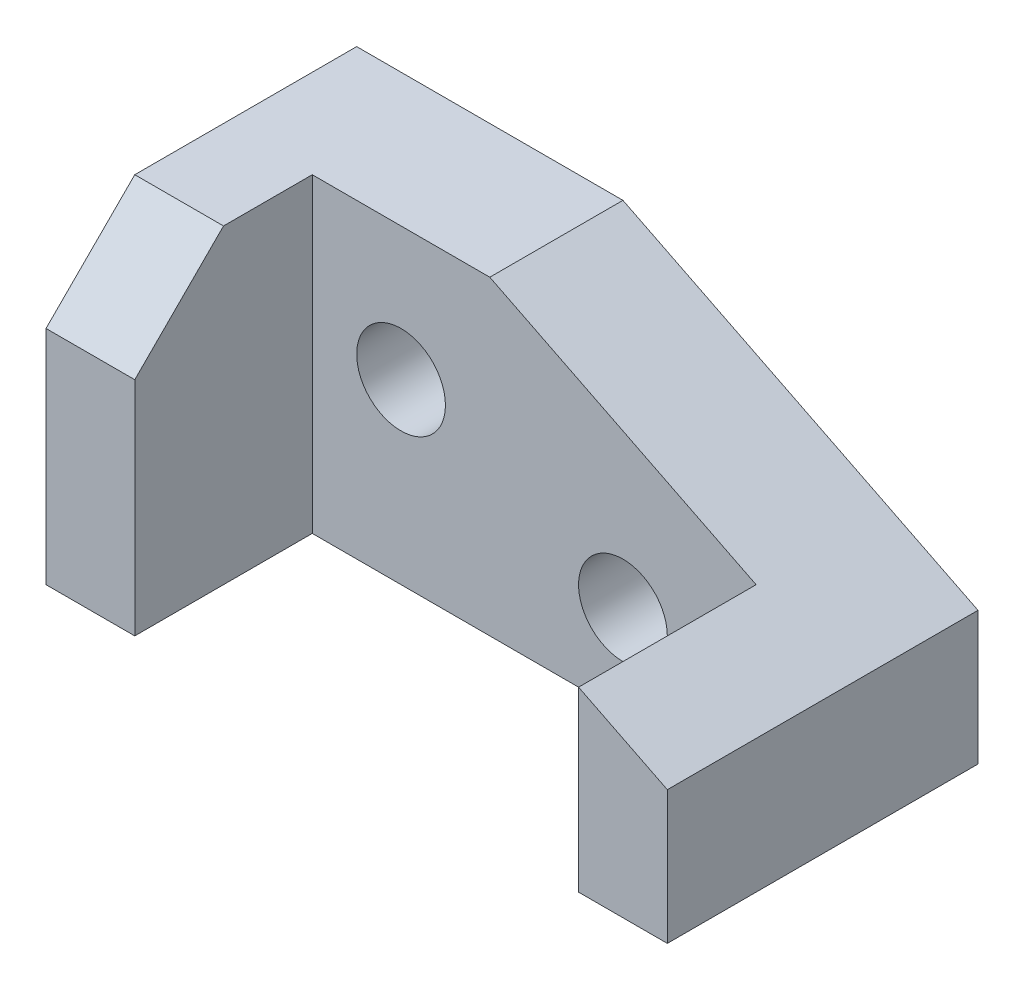
ISO-10303-21;
HEADER;
FILE_DESCRIPTION(('STEP AP214'),'2;1');
FILE_NAME('part.step','',(''),(''),'','','');
FILE_SCHEMA(('AUTOMOTIVE_DESIGN { 1 0 10303 214 1 1 1 1 }'));
ENDSEC;
DATA;
#1=APPLICATION_CONTEXT('core data for automotive mechanical design processes');
#2=APPLICATION_PROTOCOL_DEFINITION('international standard','automotive_design',2000,#1);
#3=PRODUCT_CONTEXT('',#1,'mechanical');
#4=PRODUCT('Part','Part','',(#3));
#5=PRODUCT_RELATED_PRODUCT_CATEGORY('part','',(#4));
#6=PRODUCT_DEFINITION_FORMATION('','',#4);
#7=PRODUCT_DEFINITION_CONTEXT('part definition',#1,'design');
#8=PRODUCT_DEFINITION('design','',#6,#7);
#9=PRODUCT_DEFINITION_SHAPE('','',#8);
#10=(LENGTH_UNIT() NAMED_UNIT(*) SI_UNIT(.MILLI.,.METRE.));
#11=(NAMED_UNIT(*) PLANE_ANGLE_UNIT() SI_UNIT($,.RADIAN.));
#12=(NAMED_UNIT(*) SI_UNIT($,.STERADIAN.) SOLID_ANGLE_UNIT());
#13=UNCERTAINTY_MEASURE_WITH_UNIT(LENGTH_MEASURE(1.E-05),#10,'distance_accuracy_value','');
#14=(GEOMETRIC_REPRESENTATION_CONTEXT(3) GLOBAL_UNCERTAINTY_ASSIGNED_CONTEXT((#13)) GLOBAL_UNIT_ASSIGNED_CONTEXT((#10,
#11,#12)) REPRESENTATION_CONTEXT('',''));
#15=CARTESIAN_POINT('',(0.,0.,0.));
#16=DIRECTION('',(0.,0.,1.));
#17=DIRECTION('',(1.,0.,0.));
#18=AXIS2_PLACEMENT_3D('',#15,#16,#17);
#19=CARTESIAN_POINT('',(0.,35.,0.));
#20=DIRECTION('',(0.,0.,-1.));
#21=DIRECTION('',(-1.,0.,0.));
#22=AXIS2_PLACEMENT_3D('',#19,#20,#21);
#23=PLANE('',#22);
#24=DIRECTION('',(0.,1.,0.));
#25=VECTOR('',#24,1.);
#26=CARTESIAN_POINT('',(10.,0.,0.));
#27=LINE('',#26,#25);
#28=CARTESIAN_POINT('',(10.,0.,0.));
#29=VERTEX_POINT('',#28);
#30=CARTESIAN_POINT('',(10.,25.,0.));
#31=VERTEX_POINT('',#30);
#32=EDGE_CURVE('E149',#29,#31,#27,.T.);
#33=ORIENTED_EDGE('',*,*,#32,.T.);
#34=DIRECTION('',(-1.,0.,0.));
#35=VECTOR('',#34,1.);
#36=CARTESIAN_POINT('',(35.,25.,0.));
#37=LINE('',#36,#35);
#38=CARTESIAN_POINT('',(0.,25.,0.));
#39=VERTEX_POINT('',#38);
#40=EDGE_CURVE('E55',#31,#39,#37,.T.);
#41=ORIENTED_EDGE('',*,*,#40,.T.);
#42=DIRECTION('',(0.,-1.,0.));
#43=VECTOR('',#42,1.);
#44=CARTESIAN_POINT('',(0.,35.,0.));
#45=LINE('',#44,#43);
#46=CARTESIAN_POINT('',(0.,0.,0.));
#47=VERTEX_POINT('',#46);
#48=EDGE_CURVE('E130',#39,#47,#45,.T.);
#49=ORIENTED_EDGE('',*,*,#48,.T.);
#50=DIRECTION('',(1.,0.,0.));
#51=VECTOR('',#50,1.);
#52=CARTESIAN_POINT('',(0.,0.,0.));
#53=LINE('',#52,#51);
#54=EDGE_CURVE('E157',#47,#29,#53,.T.);
#55=ORIENTED_EDGE('',*,*,#54,.T.);
#56=EDGE_LOOP('',(#33,#41,#49,#55));
#57=FACE_BOUND('',#56,.T.);
#58=ADVANCED_FACE('F39',(#57),#23,.F.);
#59=CARTESIAN_POINT('',(0.,35.,0.));
#60=DIRECTION('',(1.,0.,0.));
#61=DIRECTION('',(0.,0.,-1.));
#62=AXIS2_PLACEMENT_3D('',#59,#60,#61);
#63=PLANE('',#62);
#64=ORIENTED_EDGE('',*,*,#48,.F.);
#65=DIRECTION('',(0.,-0.707106781186548,0.707106781186547));
#66=VECTOR('',#65,1.);
#67=CARTESIAN_POINT('',(0.,35.,-10.));
#68=LINE('',#67,#66);
#69=CARTESIAN_POINT('',(0.,35.,-10.));
#70=VERTEX_POINT('',#69);
#71=EDGE_CURVE('E117',#70,#39,#68,.T.);
#72=ORIENTED_EDGE('',*,*,#71,.F.);
#73=DIRECTION('',(0.,0.,1.));
#74=VECTOR('',#73,1.);
#75=CARTESIAN_POINT('',(0.,35.,0.));
#76=LINE('',#75,#74);
#77=CARTESIAN_POINT('',(0.,35.,-35.));
#78=VERTEX_POINT('',#77);
#79=EDGE_CURVE('E128',#78,#70,#76,.T.);
#80=ORIENTED_EDGE('',*,*,#79,.F.);
#81=DIRECTION('',(0.,-1.,0.));
#82=VECTOR('',#81,1.);
#83=CARTESIAN_POINT('',(0.,35.,-35.));
#84=LINE('',#83,#82);
#85=CARTESIAN_POINT('',(0.,0.,-35.));
#86=VERTEX_POINT('',#85);
#87=EDGE_CURVE('E144',#78,#86,#84,.T.);
#88=ORIENTED_EDGE('',*,*,#87,.T.);
#89=DIRECTION('',(0.,0.,1.));
#90=VECTOR('',#89,1.);
#91=CARTESIAN_POINT('',(0.,0.,0.));
#92=LINE('',#91,#90);
#93=EDGE_CURVE('E152',#86,#47,#92,.T.);
#94=ORIENTED_EDGE('',*,*,#93,.T.);
#95=EDGE_LOOP('',(#64,#72,#80,#88,#94));
#96=FACE_BOUND('',#95,.T.);
#97=ADVANCED_FACE('F41',(#96),#63,.F.);
#98=DIRECTION('',(0.,-1.,0.));
#99=VECTOR('',#98,1.);
#100=CARTESIAN_POINT('',(70.,35.,0.));
#101=LINE('',#100,#99);
#102=CARTESIAN_POINT('',(70.,15.,0.));
#103=VERTEX_POINT('',#102);
#104=CARTESIAN_POINT('',(70.,0.,0.));
#105=VERTEX_POINT('',#104);
#106=EDGE_CURVE('E169',#103,#105,#101,.T.);
#107=ORIENTED_EDGE('',*,*,#106,.F.);
#108=DIRECTION('',(-0.894427190999916,0.447213595499958,0.));
#109=VECTOR('',#108,1.);
#110=CARTESIAN_POINT('',(70.,15.,0.));
#111=LINE('',#110,#109);
#112=CARTESIAN_POINT('',(60.,20.,0.));
#113=VERTEX_POINT('',#112);
#114=EDGE_CURVE('E217',#103,#113,#111,.T.);
#115=ORIENTED_EDGE('',*,*,#114,.T.);
#116=DIRECTION('',(0.,1.,0.));
#117=VECTOR('',#116,1.);
#118=CARTESIAN_POINT('',(60.,0.,0.));
#119=LINE('',#118,#117);
#120=CARTESIAN_POINT('',(60.,0.,0.));
#121=VERTEX_POINT('',#120);
#122=EDGE_CURVE('E182',#121,#113,#119,.T.);
#123=ORIENTED_EDGE('',*,*,#122,.F.);
#124=EDGE_CURVE('E155',#121,#105,#53,.T.);
#125=ORIENTED_EDGE('',*,*,#124,.T.);
#126=EDGE_LOOP('',(#107,#115,#123,#125));
#127=FACE_BOUND('',#126,.T.);
#128=ADVANCED_FACE('F283',(#127),#23,.F.);
#129=CARTESIAN_POINT('',(70.,35.,0.));
#130=DIRECTION('',(-1.,0.,0.));
#131=DIRECTION('',(0.,0.,1.));
#132=AXIS2_PLACEMENT_3D('',#129,#130,#131);
#133=PLANE('',#132);
#134=DIRECTION('',(0.,-1.,0.));
#135=VECTOR('',#134,1.);
#136=CARTESIAN_POINT('',(70.,35.,-35.));
#137=LINE('',#136,#135);
#138=CARTESIAN_POINT('',(70.,15.,-35.));
#139=VERTEX_POINT('',#138);
#140=CARTESIAN_POINT('',(70.,0.,-35.));
#141=VERTEX_POINT('',#140);
#142=EDGE_CURVE('E166',#139,#141,#137,.T.);
#143=ORIENTED_EDGE('',*,*,#142,.F.);
#144=DIRECTION('',(0.,0.,-1.));
#145=VECTOR('',#144,1.);
#146=CARTESIAN_POINT('',(70.,15.,0.));
#147=LINE('',#146,#145);
#148=EDGE_CURVE('E214',#103,#139,#147,.T.);
#149=ORIENTED_EDGE('',*,*,#148,.F.);
#150=ORIENTED_EDGE('',*,*,#106,.T.);
#151=DIRECTION('',(0.,0.,-1.));
#152=VECTOR('',#151,1.);
#153=CARTESIAN_POINT('',(70.,0.,0.));
#154=LINE('',#153,#152);
#155=EDGE_CURVE('E146',#105,#141,#154,.T.);
#156=ORIENTED_EDGE('',*,*,#155,.T.);
#157=EDGE_LOOP('',(#143,#149,#150,#156));
#158=FACE_BOUND('',#157,.T.);
#159=ADVANCED_FACE('F261',(#158),#133,.F.);
#160=CARTESIAN_POINT('',(0.,35.,-35.));
#161=DIRECTION('',(0.,0.,1.));
#162=DIRECTION('',(1.,0.,0.));
#163=AXIS2_PLACEMENT_3D('',#160,#161,#162);
#164=PLANE('',#163);
#165=CARTESIAN_POINT('',(45.,10.,-35.));
#166=DIRECTION('',(0.,0.,1.));
#167=DIRECTION('',(1.,0.,0.));
#168=AXIS2_PLACEMENT_3D('',#165,#166,#167);
#169=CIRCLE('',#168,5.);
#170=CARTESIAN_POINT('',(50.,10.,-35.));
#171=VERTEX_POINT('',#170);
#172=EDGE_CURVE('E234',#171,#171,#169,.T.);
#173=ORIENTED_EDGE('',*,*,#172,.T.);
#174=EDGE_LOOP('',(#173));
#175=FACE_BOUND('',#174,.T.);
#176=CARTESIAN_POINT('',(20.,20.,-35.));
#177=DIRECTION('',(0.,0.,1.));
#178=DIRECTION('',(1.,0.,0.));
#179=AXIS2_PLACEMENT_3D('',#176,#177,#178);
#180=CIRCLE('',#179,5.);
#181=CARTESIAN_POINT('',(25.,20.,-35.));
#182=VERTEX_POINT('',#181);
#183=EDGE_CURVE('E132',#182,#182,#180,.T.);
#184=ORIENTED_EDGE('',*,*,#183,.T.);
#185=EDGE_LOOP('',(#184));
#186=FACE_BOUND('',#185,.T.);
#187=DIRECTION('',(-1.,0.,0.));
#188=VECTOR('',#187,1.);
#189=CARTESIAN_POINT('',(0.,35.,-35.));
#190=LINE('',#189,#188);
#191=CARTESIAN_POINT('',(30.,35.,-35.));
#192=VERTEX_POINT('',#191);
#193=EDGE_CURVE('E137',#192,#78,#190,.T.);
#194=ORIENTED_EDGE('',*,*,#193,.F.);
#195=DIRECTION('',(-0.894427190999916,0.447213595499958,0.));
#196=VECTOR('',#195,1.);
#197=CARTESIAN_POINT('',(70.,15.,-35.));
#198=LINE('',#197,#196);
#199=EDGE_CURVE('E220',#139,#192,#198,.T.);
#200=ORIENTED_EDGE('',*,*,#199,.F.);
#201=ORIENTED_EDGE('',*,*,#142,.T.);
#202=DIRECTION('',(-1.,0.,0.));
#203=VECTOR('',#202,1.);
#204=CARTESIAN_POINT('',(0.,0.,-35.));
#205=LINE('',#204,#203);
#206=EDGE_CURVE('E140',#141,#86,#205,.T.);
#207=ORIENTED_EDGE('',*,*,#206,.T.);
#208=ORIENTED_EDGE('',*,*,#87,.F.);
#209=EDGE_LOOP('',(#194,#200,#201,#207,#208));
#210=FACE_BOUND('',#209,.T.);
#211=ADVANCED_FACE('F258',(#175,#186,#210),#164,.F.);
#212=CARTESIAN_POINT('',(0.,35.,0.));
#213=DIRECTION('',(0.,-1.,0.));
#214=DIRECTION('',(0.,0.,-1.));
#215=AXIS2_PLACEMENT_3D('',#212,#213,#214);
#216=PLANE('',#215);
#217=ORIENTED_EDGE('',*,*,#79,.T.);
#218=DIRECTION('',(-1.,0.,0.));
#219=VECTOR('',#218,1.);
#220=CARTESIAN_POINT('',(35.,35.,-10.));
#221=LINE('',#220,#219);
#222=CARTESIAN_POINT('',(10.,35.,-10.));
#223=VERTEX_POINT('',#222);
#224=EDGE_CURVE('E114',#223,#70,#221,.T.);
#225=ORIENTED_EDGE('',*,*,#224,.F.);
#226=DIRECTION('',(0.,0.,1.));
#227=VECTOR('',#226,1.);
#228=CARTESIAN_POINT('',(10.,35.,0.));
#229=LINE('',#228,#227);
#230=CARTESIAN_POINT('',(10.,35.,-20.));
#231=VERTEX_POINT('',#230);
#232=EDGE_CURVE('E200',#231,#223,#229,.T.);
#233=ORIENTED_EDGE('',*,*,#232,.F.);
#234=DIRECTION('',(-1.,0.,0.));
#235=VECTOR('',#234,1.);
#236=CARTESIAN_POINT('',(10.,35.,-20.));
#237=LINE('',#236,#235);
#238=CARTESIAN_POINT('',(30.,35.,-20.));
#239=VERTEX_POINT('',#238);
#240=EDGE_CURVE('E196',#239,#231,#237,.T.);
#241=ORIENTED_EDGE('',*,*,#240,.F.);
#242=DIRECTION('',(0.,0.,-1.));
#243=VECTOR('',#242,1.);
#244=CARTESIAN_POINT('',(30.,35.,0.));
#245=LINE('',#244,#243);
#246=EDGE_CURVE('E213',#239,#192,#245,.T.);
#247=ORIENTED_EDGE('',*,*,#246,.T.);
#248=ORIENTED_EDGE('',*,*,#193,.T.);
#249=EDGE_LOOP('',(#217,#225,#233,#241,#247,#248));
#250=FACE_BOUND('',#249,.T.);
#251=ADVANCED_FACE('F134',(#250),#216,.F.);
#252=CARTESIAN_POINT('',(0.,0.,0.));
#253=DIRECTION('',(0.,-1.,0.));
#254=DIRECTION('',(0.,0.,-1.));
#255=AXIS2_PLACEMENT_3D('',#252,#253,#254);
#256=PLANE('',#255);
#257=DIRECTION('',(0.,0.,1.));
#258=VECTOR('',#257,1.);
#259=CARTESIAN_POINT('',(10.,0.,0.));
#260=LINE('',#259,#258);
#261=CARTESIAN_POINT('',(10.,0.,-20.));
#262=VERTEX_POINT('',#261);
#263=EDGE_CURVE('E199',#262,#29,#260,.T.);
#264=ORIENTED_EDGE('',*,*,#263,.T.);
#265=ORIENTED_EDGE('',*,*,#54,.F.);
#266=ORIENTED_EDGE('',*,*,#93,.F.);
#267=ORIENTED_EDGE('',*,*,#206,.F.);
#268=ORIENTED_EDGE('',*,*,#155,.F.);
#269=ORIENTED_EDGE('',*,*,#124,.F.);
#270=DIRECTION('',(0.,0.,-1.));
#271=VECTOR('',#270,1.);
#272=CARTESIAN_POINT('',(60.,0.,0.));
#273=LINE('',#272,#271);
#274=CARTESIAN_POINT('',(60.,0.,-20.));
#275=VERTEX_POINT('',#274);
#276=EDGE_CURVE('E205',#121,#275,#273,.T.);
#277=ORIENTED_EDGE('',*,*,#276,.T.);
#278=DIRECTION('',(-1.,0.,0.));
#279=VECTOR('',#278,1.);
#280=CARTESIAN_POINT('',(10.,0.,-20.));
#281=LINE('',#280,#279);
#282=EDGE_CURVE('E188',#275,#262,#281,.T.);
#283=ORIENTED_EDGE('',*,*,#282,.T.);
#284=EDGE_LOOP('',(#264,#265,#266,#267,#268,#269,#277,#283));
#285=FACE_BOUND('',#284,.T.);
#286=ADVANCED_FACE('F270',(#285),#256,.T.);
#287=CARTESIAN_POINT('',(10.,0.,0.));
#288=DIRECTION('',(-1.,0.,0.));
#289=DIRECTION('',(0.,0.,1.));
#290=AXIS2_PLACEMENT_3D('',#287,#288,#289);
#291=PLANE('',#290);
#292=ORIENTED_EDGE('',*,*,#232,.T.);
#293=DIRECTION('',(0.,-0.707106781186548,0.707106781186547));
#294=VECTOR('',#293,1.);
#295=CARTESIAN_POINT('',(10.,12.5,12.5));
#296=LINE('',#295,#294);
#297=EDGE_CURVE('E11',#223,#31,#296,.T.);
#298=ORIENTED_EDGE('',*,*,#297,.T.);
#299=ORIENTED_EDGE('',*,*,#32,.F.);
#300=ORIENTED_EDGE('',*,*,#263,.F.);
#301=DIRECTION('',(0.,1.,0.));
#302=VECTOR('',#301,1.);
#303=CARTESIAN_POINT('',(10.,0.,-20.));
#304=LINE('',#303,#302);
#305=EDGE_CURVE('E156',#262,#231,#304,.T.);
#306=ORIENTED_EDGE('',*,*,#305,.T.);
#307=EDGE_LOOP('',(#292,#298,#299,#300,#306));
#308=FACE_BOUND('',#307,.T.);
#309=ADVANCED_FACE('F248',(#308),#291,.F.);
#310=CARTESIAN_POINT('',(10.,0.,-20.));
#311=DIRECTION('',(0.,0.,-1.));
#312=DIRECTION('',(-1.,0.,0.));
#313=AXIS2_PLACEMENT_3D('',#310,#311,#312);
#314=PLANE('',#313);
#315=CARTESIAN_POINT('',(45.,10.,-20.));
#316=DIRECTION('',(0.,0.,1.));
#317=DIRECTION('',(1.,0.,0.));
#318=AXIS2_PLACEMENT_3D('',#315,#316,#317);
#319=CIRCLE('',#318,5.);
#320=CARTESIAN_POINT('',(50.,10.,-20.));
#321=VERTEX_POINT('',#320);
#322=EDGE_CURVE('E238',#321,#321,#319,.T.);
#323=ORIENTED_EDGE('',*,*,#322,.F.);
#324=EDGE_LOOP('',(#323));
#325=FACE_BOUND('',#324,.T.);
#326=CARTESIAN_POINT('',(20.,20.,-20.));
#327=DIRECTION('',(0.,0.,1.));
#328=DIRECTION('',(1.,0.,0.));
#329=AXIS2_PLACEMENT_3D('',#326,#327,#328);
#330=CIRCLE('',#329,5.);
#331=CARTESIAN_POINT('',(25.,20.,-20.));
#332=VERTEX_POINT('',#331);
#333=EDGE_CURVE('E230',#332,#332,#330,.T.);
#334=ORIENTED_EDGE('',*,*,#333,.F.);
#335=EDGE_LOOP('',(#334));
#336=FACE_BOUND('',#335,.T.);
#337=DIRECTION('',(0.,1.,0.));
#338=VECTOR('',#337,1.);
#339=CARTESIAN_POINT('',(60.,0.,-20.));
#340=LINE('',#339,#338);
#341=CARTESIAN_POINT('',(60.,20.,-20.));
#342=VERTEX_POINT('',#341);
#343=EDGE_CURVE('E179',#275,#342,#340,.T.);
#344=ORIENTED_EDGE('',*,*,#343,.T.);
#345=DIRECTION('',(-0.894427190999916,0.447213595499958,0.));
#346=VECTOR('',#345,1.);
#347=CARTESIAN_POINT('',(28.,36.,-20.));
#348=LINE('',#347,#346);
#349=EDGE_CURVE('E62',#342,#239,#348,.T.);
#350=ORIENTED_EDGE('',*,*,#349,.T.);
#351=ORIENTED_EDGE('',*,*,#240,.T.);
#352=ORIENTED_EDGE('',*,*,#305,.F.);
#353=ORIENTED_EDGE('',*,*,#282,.F.);
#354=EDGE_LOOP('',(#344,#350,#351,#352,#353));
#355=FACE_BOUND('',#354,.T.);
#356=ADVANCED_FACE('F185',(#325,#336,#355),#314,.F.);
#357=CARTESIAN_POINT('',(60.,0.,0.));
#358=DIRECTION('',(1.,0.,0.));
#359=DIRECTION('',(0.,0.,-1.));
#360=AXIS2_PLACEMENT_3D('',#357,#358,#359);
#361=PLANE('',#360);
#362=ORIENTED_EDGE('',*,*,#122,.T.);
#363=DIRECTION('',(0.,0.,-1.));
#364=VECTOR('',#363,1.);
#365=CARTESIAN_POINT('',(60.,20.,0.));
#366=LINE('',#365,#364);
#367=EDGE_CURVE('E48',#113,#342,#366,.T.);
#368=ORIENTED_EDGE('',*,*,#367,.T.);
#369=ORIENTED_EDGE('',*,*,#343,.F.);
#370=ORIENTED_EDGE('',*,*,#276,.F.);
#371=EDGE_LOOP('',(#362,#368,#369,#370));
#372=FACE_BOUND('',#371,.T.);
#373=ADVANCED_FACE('F178',(#372),#361,.F.);
#374=CARTESIAN_POINT('',(70.,15.,0.));
#375=DIRECTION('',(-0.447213595499958,-0.894427190999916,0.));
#376=DIRECTION('',(0.894427190999916,-0.447213595499958,0.));
#377=AXIS2_PLACEMENT_3D('',#374,#375,#376);
#378=PLANE('',#377);
#379=ORIENTED_EDGE('',*,*,#367,.F.);
#380=ORIENTED_EDGE('',*,*,#114,.F.);
#381=ORIENTED_EDGE('',*,*,#148,.T.);
#382=ORIENTED_EDGE('',*,*,#199,.T.);
#383=ORIENTED_EDGE('',*,*,#246,.F.);
#384=ORIENTED_EDGE('',*,*,#349,.F.);
#385=EDGE_LOOP('',(#379,#380,#381,#382,#383,#384));
#386=FACE_BOUND('',#385,.T.);
#387=ADVANCED_FACE('F277',(#386),#378,.F.);
#388=CARTESIAN_POINT('',(35.,35.,-10.));
#389=DIRECTION('',(0.,-0.707106781186548,-0.707106781186548));
#390=DIRECTION('',(0.,0.707106781186548,-0.707106781186547));
#391=AXIS2_PLACEMENT_3D('',#388,#389,#390);
#392=PLANE('',#391);
#393=ORIENTED_EDGE('',*,*,#224,.T.);
#394=ORIENTED_EDGE('',*,*,#71,.T.);
#395=ORIENTED_EDGE('',*,*,#40,.F.);
#396=ORIENTED_EDGE('',*,*,#297,.F.);
#397=EDGE_LOOP('',(#393,#394,#395,#396));
#398=FACE_BOUND('',#397,.T.);
#399=ADVANCED_FACE('F116',(#398),#392,.F.);
#400=CARTESIAN_POINT('',(20.,20.,-55.));
#401=DIRECTION('',(0.,0.,1.));
#402=DIRECTION('',(1.,0.,0.));
#403=AXIS2_PLACEMENT_3D('',#400,#401,#402);
#404=CYLINDRICAL_SURFACE('',#403,5.);
#405=ORIENTED_EDGE('',*,*,#333,.T.);
#406=EDGE_LOOP('',(#405));
#407=FACE_BOUND('',#406,.T.);
#408=ORIENTED_EDGE('',*,*,#183,.F.);
#409=EDGE_LOOP('',(#408));
#410=FACE_BOUND('',#409,.T.);
#411=ADVANCED_FACE('F252',(#407,#410),#404,.F.);
#412=CARTESIAN_POINT('',(45.,10.,-55.));
#413=DIRECTION('',(0.,0.,1.));
#414=DIRECTION('',(1.,0.,0.));
#415=AXIS2_PLACEMENT_3D('',#412,#413,#414);
#416=CYLINDRICAL_SURFACE('',#415,5.);
#417=ORIENTED_EDGE('',*,*,#322,.T.);
#418=EDGE_LOOP('',(#417));
#419=FACE_BOUND('',#418,.T.);
#420=ORIENTED_EDGE('',*,*,#172,.F.);
#421=EDGE_LOOP('',(#420));
#422=FACE_BOUND('',#421,.T.);
#423=ADVANCED_FACE('F243',(#419,#422),#416,.F.);
#424=CLOSED_SHELL('',(#58,#97,#128,#159,#211,#251,#286,#309,#356,#373,#387,#399,#411,#423));
#425=MANIFOLD_SOLID_BREP('B2',#424);
#426=ADVANCED_BREP_SHAPE_REPRESENTATION('',(#18,#425),#14);
#427=SHAPE_DEFINITION_REPRESENTATION(#9,#426);
ENDSEC;
END-ISO-10303-21;
